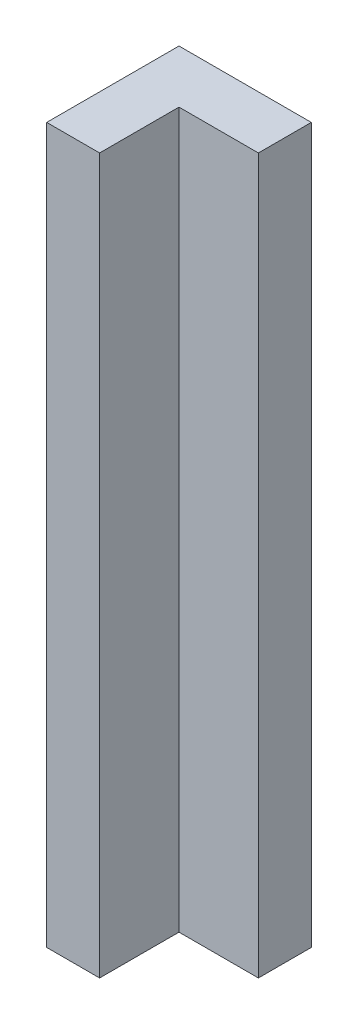
ISO-10303-21;
HEADER;
FILE_DESCRIPTION(('STEP AP214'),'2;1');
FILE_NAME('part.step','',(''),(''),'','','');
FILE_SCHEMA(('AUTOMOTIVE_DESIGN { 1 0 10303 214 1 1 1 1 }'));
ENDSEC;
DATA;
#1=APPLICATION_CONTEXT('core data for automotive mechanical design processes');
#2=APPLICATION_PROTOCOL_DEFINITION('international standard','automotive_design',2000,#1);
#3=PRODUCT_CONTEXT('',#1,'mechanical');
#4=PRODUCT('Part','Part','',(#3));
#5=PRODUCT_RELATED_PRODUCT_CATEGORY('part','',(#4));
#6=PRODUCT_DEFINITION_FORMATION('','',#4);
#7=PRODUCT_DEFINITION_CONTEXT('part definition',#1,'design');
#8=PRODUCT_DEFINITION('design','',#6,#7);
#9=PRODUCT_DEFINITION_SHAPE('','',#8);
#10=(LENGTH_UNIT() NAMED_UNIT(*) SI_UNIT(.MILLI.,.METRE.));
#11=(NAMED_UNIT(*) PLANE_ANGLE_UNIT() SI_UNIT($,.RADIAN.));
#12=(NAMED_UNIT(*) SI_UNIT($,.STERADIAN.) SOLID_ANGLE_UNIT());
#13=UNCERTAINTY_MEASURE_WITH_UNIT(LENGTH_MEASURE(1.E-05),#10,'distance_accuracy_value','');
#14=(GEOMETRIC_REPRESENTATION_CONTEXT(3) GLOBAL_UNCERTAINTY_ASSIGNED_CONTEXT((#13)) GLOBAL_UNIT_ASSIGNED_CONTEXT((#10,
#11,#12)) REPRESENTATION_CONTEXT('',''));
#15=CARTESIAN_POINT('',(0.,0.,0.));
#16=DIRECTION('',(0.,0.,1.));
#17=DIRECTION('',(1.,0.,0.));
#18=AXIS2_PLACEMENT_3D('',#15,#16,#17);
#19=CARTESIAN_POINT('',(-7.70104251709067,27.,2.5));
#20=DIRECTION('',(1.,0.,0.));
#21=DIRECTION('',(0.,0.,-1.));
#22=AXIS2_PLACEMENT_3D('',#19,#20,#21);
#23=PLANE('',#22);
#24=DIRECTION('',(0.,0.,1.));
#25=VECTOR('',#24,1.);
#26=CARTESIAN_POINT('',(-7.70104251709067,0.,2.5));
#27=LINE('',#26,#25);
#28=CARTESIAN_POINT('',(-7.70104251709067,0.,-2.5));
#29=VERTEX_POINT('',#28);
#30=CARTESIAN_POINT('',(-7.70104251709067,0.,2.5));
#31=VERTEX_POINT('',#30);
#32=EDGE_CURVE('E138',#29,#31,#27,.T.);
#33=ORIENTED_EDGE('',*,*,#32,.T.);
#34=DIRECTION('',(0.,-1.,0.));
#35=VECTOR('',#34,1.);
#36=CARTESIAN_POINT('',(-7.70104251709067,27.,2.5));
#37=LINE('',#36,#35);
#38=CARTESIAN_POINT('',(-7.70104251709067,27.,2.5));
#39=VERTEX_POINT('',#38);
#40=EDGE_CURVE('E54',#39,#31,#37,.T.);
#41=ORIENTED_EDGE('',*,*,#40,.F.);
#42=DIRECTION('',(0.,0.,1.));
#43=VECTOR('',#42,1.);
#44=CARTESIAN_POINT('',(-7.70104251709067,27.,2.5));
#45=LINE('',#44,#43);
#46=CARTESIAN_POINT('',(-7.70104251709067,27.,-2.5));
#47=VERTEX_POINT('',#46);
#48=EDGE_CURVE('E100',#47,#39,#45,.T.);
#49=ORIENTED_EDGE('',*,*,#48,.F.);
#50=DIRECTION('',(0.,-1.,0.));
#51=VECTOR('',#50,1.);
#52=CARTESIAN_POINT('',(-7.70104251709067,27.,-2.5));
#53=LINE('',#52,#51);
#54=EDGE_CURVE('E11',#47,#29,#53,.T.);
#55=ORIENTED_EDGE('',*,*,#54,.T.);
#56=EDGE_LOOP('',(#33,#41,#49,#55));
#57=FACE_BOUND('',#56,.T.);
#58=ADVANCED_FACE('F45',(#57),#23,.F.);
#59=CARTESIAN_POINT('',(-5.70104251709067,27.,2.5));
#60=DIRECTION('',(0.,0.,-1.));
#61=DIRECTION('',(-1.,0.,0.));
#62=AXIS2_PLACEMENT_3D('',#59,#60,#61);
#63=PLANE('',#62);
#64=DIRECTION('',(1.,0.,0.));
#65=VECTOR('',#64,1.);
#66=CARTESIAN_POINT('',(-5.70104251709067,0.,2.5));
#67=LINE('',#66,#65);
#68=CARTESIAN_POINT('',(-5.70104251709067,0.,2.5));
#69=VERTEX_POINT('',#68);
#70=EDGE_CURVE('E141',#31,#69,#67,.T.);
#71=ORIENTED_EDGE('',*,*,#70,.T.);
#72=DIRECTION('',(0.,-1.,0.));
#73=VECTOR('',#72,1.);
#74=CARTESIAN_POINT('',(-5.70104251709067,27.,2.5));
#75=LINE('',#74,#73);
#76=CARTESIAN_POINT('',(-5.70104251709067,27.,2.5));
#77=VERTEX_POINT('',#76);
#78=EDGE_CURVE('E125',#77,#69,#75,.T.);
#79=ORIENTED_EDGE('',*,*,#78,.F.);
#80=DIRECTION('',(1.,0.,0.));
#81=VECTOR('',#80,1.);
#82=CARTESIAN_POINT('',(-5.70104251709067,27.,2.5));
#83=LINE('',#82,#81);
#84=EDGE_CURVE('E114',#39,#77,#83,.T.);
#85=ORIENTED_EDGE('',*,*,#84,.F.);
#86=ORIENTED_EDGE('',*,*,#40,.T.);
#87=EDGE_LOOP('',(#71,#79,#85,#86));
#88=FACE_BOUND('',#87,.T.);
#89=ADVANCED_FACE('F162',(#88),#63,.F.);
#90=CARTESIAN_POINT('',(-5.70104251709067,27.,-0.499999999999999));
#91=DIRECTION('',(-1.,0.,0.));
#92=DIRECTION('',(0.,0.,1.));
#93=AXIS2_PLACEMENT_3D('',#90,#91,#92);
#94=PLANE('',#93);
#95=DIRECTION('',(0.,0.,-1.));
#96=VECTOR('',#95,1.);
#97=CARTESIAN_POINT('',(-5.70104251709067,0.,-0.499999999999999));
#98=LINE('',#97,#96);
#99=CARTESIAN_POINT('',(-5.70104251709067,0.,-0.499999999999999));
#100=VERTEX_POINT('',#99);
#101=EDGE_CURVE('E123',#69,#100,#98,.T.);
#102=ORIENTED_EDGE('',*,*,#101,.T.);
#103=DIRECTION('',(0.,-1.,0.));
#104=VECTOR('',#103,1.);
#105=CARTESIAN_POINT('',(-5.70104251709067,27.,-0.499999999999999));
#106=LINE('',#105,#104);
#107=CARTESIAN_POINT('',(-5.70104251709067,27.,-0.499999999999999));
#108=VERTEX_POINT('',#107);
#109=EDGE_CURVE('E120',#108,#100,#106,.T.);
#110=ORIENTED_EDGE('',*,*,#109,.F.);
#111=DIRECTION('',(0.,0.,-1.));
#112=VECTOR('',#111,1.);
#113=CARTESIAN_POINT('',(-5.70104251709067,27.,-0.499999999999999));
#114=LINE('',#113,#112);
#115=EDGE_CURVE('E108',#77,#108,#114,.T.);
#116=ORIENTED_EDGE('',*,*,#115,.F.);
#117=ORIENTED_EDGE('',*,*,#78,.T.);
#118=EDGE_LOOP('',(#102,#110,#116,#117));
#119=FACE_BOUND('',#118,.T.);
#120=ADVANCED_FACE('F121',(#119),#94,.F.);
#121=CARTESIAN_POINT('',(-2.70104251709066,27.,-0.5));
#122=DIRECTION('',(0.,0.,-1.));
#123=DIRECTION('',(-1.,0.,0.));
#124=AXIS2_PLACEMENT_3D('',#121,#122,#123);
#125=PLANE('',#124);
#126=DIRECTION('',(1.,0.,0.));
#127=VECTOR('',#126,1.);
#128=CARTESIAN_POINT('',(-2.70104251709066,0.,-0.5));
#129=LINE('',#128,#127);
#130=CARTESIAN_POINT('',(-2.70104251709066,0.,-0.5));
#131=VERTEX_POINT('',#130);
#132=EDGE_CURVE('E86',#100,#131,#129,.T.);
#133=ORIENTED_EDGE('',*,*,#132,.T.);
#134=DIRECTION('',(0.,-1.,0.));
#135=VECTOR('',#134,1.);
#136=CARTESIAN_POINT('',(-2.70104251709066,27.,-0.5));
#137=LINE('',#136,#135);
#138=CARTESIAN_POINT('',(-2.70104251709066,27.,-0.5));
#139=VERTEX_POINT('',#138);
#140=EDGE_CURVE('E126',#139,#131,#137,.T.);
#141=ORIENTED_EDGE('',*,*,#140,.F.);
#142=DIRECTION('',(1.,0.,0.));
#143=VECTOR('',#142,1.);
#144=CARTESIAN_POINT('',(-2.70104251709066,27.,-0.5));
#145=LINE('',#144,#143);
#146=EDGE_CURVE('E112',#108,#139,#145,.T.);
#147=ORIENTED_EDGE('',*,*,#146,.F.);
#148=ORIENTED_EDGE('',*,*,#109,.T.);
#149=EDGE_LOOP('',(#133,#141,#147,#148));
#150=FACE_BOUND('',#149,.T.);
#151=ADVANCED_FACE('F128',(#150),#125,.F.);
#152=CARTESIAN_POINT('',(-2.70104251709066,27.,-2.5));
#153=DIRECTION('',(-1.,0.,0.));
#154=DIRECTION('',(0.,0.,1.));
#155=AXIS2_PLACEMENT_3D('',#152,#153,#154);
#156=PLANE('',#155);
#157=DIRECTION('',(0.,0.,-1.));
#158=VECTOR('',#157,1.);
#159=CARTESIAN_POINT('',(-2.70104251709066,0.,-2.5));
#160=LINE('',#159,#158);
#161=CARTESIAN_POINT('',(-2.70104251709066,0.,-2.5));
#162=VERTEX_POINT('',#161);
#163=EDGE_CURVE('E93',#131,#162,#160,.T.);
#164=ORIENTED_EDGE('',*,*,#163,.T.);
#165=DIRECTION('',(0.,-1.,0.));
#166=VECTOR('',#165,1.);
#167=CARTESIAN_POINT('',(-2.70104251709066,27.,-2.5));
#168=LINE('',#167,#166);
#169=CARTESIAN_POINT('',(-2.70104251709066,27.,-2.5));
#170=VERTEX_POINT('',#169);
#171=EDGE_CURVE('E134',#170,#162,#168,.T.);
#172=ORIENTED_EDGE('',*,*,#171,.F.);
#173=DIRECTION('',(0.,0.,-1.));
#174=VECTOR('',#173,1.);
#175=CARTESIAN_POINT('',(-2.70104251709066,27.,-2.5));
#176=LINE('',#175,#174);
#177=EDGE_CURVE('E131',#139,#170,#176,.T.);
#178=ORIENTED_EDGE('',*,*,#177,.F.);
#179=ORIENTED_EDGE('',*,*,#140,.T.);
#180=EDGE_LOOP('',(#164,#172,#178,#179));
#181=FACE_BOUND('',#180,.T.);
#182=ADVANCED_FACE('F168',(#181),#156,.F.);
#183=CARTESIAN_POINT('',(-6.43239163356095,27.,-2.5));
#184=DIRECTION('',(0.,0.,1.));
#185=DIRECTION('',(1.,0.,0.));
#186=AXIS2_PLACEMENT_3D('',#183,#184,#185);
#187=PLANE('',#186);
#188=DIRECTION('',(-1.,0.,0.));
#189=VECTOR('',#188,1.);
#190=CARTESIAN_POINT('',(-6.43239163356095,0.,-2.5));
#191=LINE('',#190,#189);
#192=EDGE_CURVE('E150',#162,#29,#191,.T.);
#193=ORIENTED_EDGE('',*,*,#192,.T.);
#194=ORIENTED_EDGE('',*,*,#54,.F.);
#195=DIRECTION('',(-1.,0.,0.));
#196=VECTOR('',#195,1.);
#197=CARTESIAN_POINT('',(-7.70104251709067,27.,-2.5));
#198=LINE('',#197,#196);
#199=EDGE_CURVE('E62',#170,#47,#198,.T.);
#200=ORIENTED_EDGE('',*,*,#199,.F.);
#201=ORIENTED_EDGE('',*,*,#171,.T.);
#202=EDGE_LOOP('',(#193,#194,#200,#201));
#203=FACE_BOUND('',#202,.T.);
#204=ADVANCED_FACE('F167',(#203),#187,.F.);
#205=CARTESIAN_POINT('',(0.,27.,0.));
#206=DIRECTION('',(0.,-1.,0.));
#207=DIRECTION('',(0.,0.,-1.));
#208=AXIS2_PLACEMENT_3D('',#205,#206,#207);
#209=PLANE('',#208);
#210=ORIENTED_EDGE('',*,*,#199,.T.);
#211=ORIENTED_EDGE('',*,*,#48,.T.);
#212=ORIENTED_EDGE('',*,*,#84,.T.);
#213=ORIENTED_EDGE('',*,*,#115,.T.);
#214=ORIENTED_EDGE('',*,*,#146,.T.);
#215=ORIENTED_EDGE('',*,*,#177,.T.);
#216=EDGE_LOOP('',(#210,#211,#212,#213,#214,#215));
#217=FACE_BOUND('',#216,.T.);
#218=ADVANCED_FACE('F110',(#217),#209,.F.);
#219=CARTESIAN_POINT('',(0.,0.,0.));
#220=DIRECTION('',(0.,-1.,0.));
#221=DIRECTION('',(0.,0.,-1.));
#222=AXIS2_PLACEMENT_3D('',#219,#220,#221);
#223=PLANE('',#222);
#224=ORIENTED_EDGE('',*,*,#32,.F.);
#225=ORIENTED_EDGE('',*,*,#192,.F.);
#226=ORIENTED_EDGE('',*,*,#163,.F.);
#227=ORIENTED_EDGE('',*,*,#132,.F.);
#228=ORIENTED_EDGE('',*,*,#101,.F.);
#229=ORIENTED_EDGE('',*,*,#70,.F.);
#230=EDGE_LOOP('',(#224,#225,#226,#227,#228,#229));
#231=FACE_BOUND('',#230,.T.);
#232=ADVANCED_FACE('F165',(#231),#223,.T.);
#233=CLOSED_SHELL('',(#58,#89,#120,#151,#182,#204,#218,#232));
#234=MANIFOLD_SOLID_BREP('B2',#233);
#235=ADVANCED_BREP_SHAPE_REPRESENTATION('',(#18,#234),#14);
#236=SHAPE_DEFINITION_REPRESENTATION(#9,#235);
ENDSEC;
END-ISO-10303-21;
